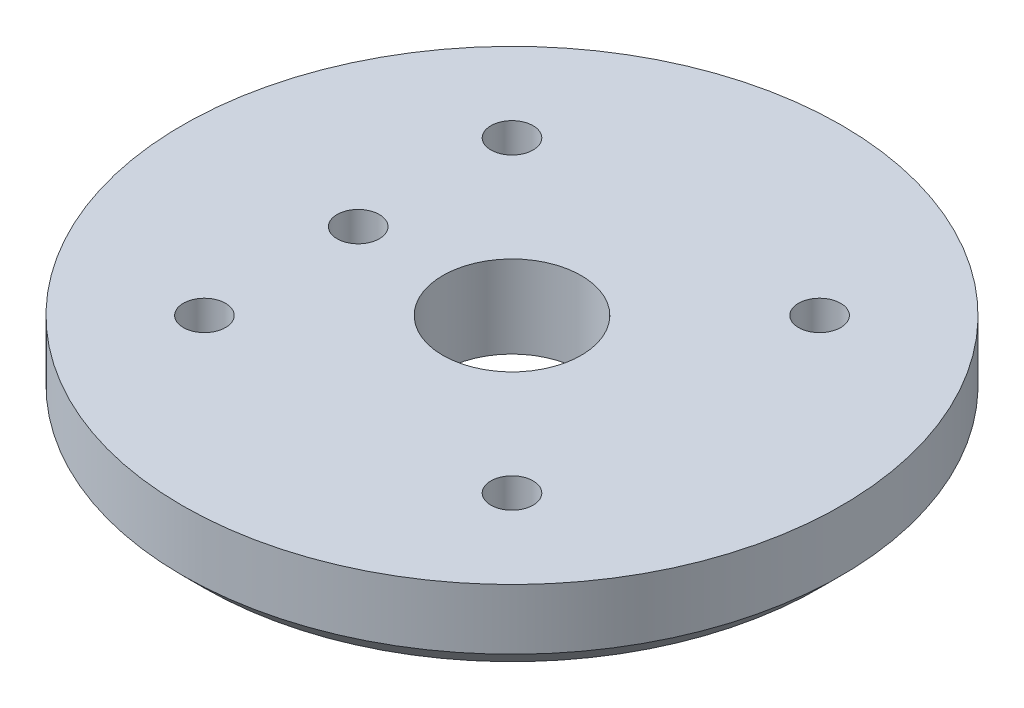
ISO-10303-21;
HEADER;
FILE_DESCRIPTION(('STEP AP214'),'2;1');
FILE_NAME('part.step','',(''),(''),'','','');
FILE_SCHEMA(('AUTOMOTIVE_DESIGN { 1 0 10303 214 1 1 1 1 }'));
ENDSEC;
DATA;
#1=APPLICATION_CONTEXT('core data for automotive mechanical design processes');
#2=APPLICATION_PROTOCOL_DEFINITION('international standard','automotive_design',2000,#1);
#3=PRODUCT_CONTEXT('',#1,'mechanical');
#4=PRODUCT('Part','Part','',(#3));
#5=PRODUCT_RELATED_PRODUCT_CATEGORY('part','',(#4));
#6=PRODUCT_DEFINITION_FORMATION('','',#4);
#7=PRODUCT_DEFINITION_CONTEXT('part definition',#1,'design');
#8=PRODUCT_DEFINITION('design','',#6,#7);
#9=PRODUCT_DEFINITION_SHAPE('','',#8);
#10=(LENGTH_UNIT() NAMED_UNIT(*) SI_UNIT(.MILLI.,.METRE.));
#11=(NAMED_UNIT(*) PLANE_ANGLE_UNIT() SI_UNIT($,.RADIAN.));
#12=(NAMED_UNIT(*) SI_UNIT($,.STERADIAN.) SOLID_ANGLE_UNIT());
#13=UNCERTAINTY_MEASURE_WITH_UNIT(LENGTH_MEASURE(1.E-05),#10,'distance_accuracy_value','');
#14=(GEOMETRIC_REPRESENTATION_CONTEXT(3) GLOBAL_UNCERTAINTY_ASSIGNED_CONTEXT((#13)) GLOBAL_UNIT_ASSIGNED_CONTEXT((#10,
#11,#12)) REPRESENTATION_CONTEXT('',''));
#15=CARTESIAN_POINT('',(0.,0.,0.));
#16=DIRECTION('',(0.,0.,1.));
#17=DIRECTION('',(1.,0.,0.));
#18=AXIS2_PLACEMENT_3D('',#15,#16,#17);
#19=CARTESIAN_POINT('',(0.,4.7625,0.));
#20=DIRECTION('',(0.,1.,0.));
#21=DIRECTION('',(0.,0.,1.));
#22=AXIS2_PLACEMENT_3D('',#19,#20,#21);
#23=PLANE('',#22);
#24=CARTESIAN_POINT('',(-8.89,4.7625,-8.89));
#25=DIRECTION('',(0.,1.,0.));
#26=DIRECTION('',(0.,0.,1.));
#27=AXIS2_PLACEMENT_3D('',#24,#25,#26);
#28=CIRCLE('',#27,1.2192);
#29=CARTESIAN_POINT('',(-8.89,4.7625,-7.6708));
#30=VERTEX_POINT('',#29);
#31=EDGE_CURVE('E85',#30,#30,#28,.T.);
#32=ORIENTED_EDGE('',*,*,#31,.F.);
#33=EDGE_LOOP('',(#32));
#34=FACE_BOUND('',#33,.T.);
#35=CARTESIAN_POINT('',(8.89,4.7625,-8.89));
#36=DIRECTION('',(0.,1.,0.));
#37=DIRECTION('',(0.,0.,1.));
#38=AXIS2_PLACEMENT_3D('',#35,#36,#37);
#39=CIRCLE('',#38,1.2192);
#40=CARTESIAN_POINT('',(8.89,4.7625,-7.6708));
#41=VERTEX_POINT('',#40);
#42=EDGE_CURVE('E79',#41,#41,#39,.T.);
#43=ORIENTED_EDGE('',*,*,#42,.F.);
#44=EDGE_LOOP('',(#43));
#45=FACE_BOUND('',#44,.T.);
#46=CARTESIAN_POINT('',(-8.89,4.7625,8.89));
#47=DIRECTION('',(0.,1.,0.));
#48=DIRECTION('',(0.,0.,1.));
#49=AXIS2_PLACEMENT_3D('',#46,#47,#48);
#50=CIRCLE('',#49,1.2192);
#51=CARTESIAN_POINT('',(-8.89,4.7625,10.1092));
#52=VERTEX_POINT('',#51);
#53=EDGE_CURVE('E73',#52,#52,#50,.T.);
#54=ORIENTED_EDGE('',*,*,#53,.F.);
#55=EDGE_LOOP('',(#54));
#56=FACE_BOUND('',#55,.T.);
#57=CARTESIAN_POINT('',(8.89,4.7625,8.89));
#58=DIRECTION('',(0.,1.,0.));
#59=DIRECTION('',(0.,0.,1.));
#60=AXIS2_PLACEMENT_3D('',#57,#58,#59);
#61=CIRCLE('',#60,1.2192);
#62=CARTESIAN_POINT('',(8.89,4.7625,10.1092));
#63=VERTEX_POINT('',#62);
#64=EDGE_CURVE('E67',#63,#63,#61,.T.);
#65=ORIENTED_EDGE('',*,*,#64,.F.);
#66=EDGE_LOOP('',(#65));
#67=FACE_BOUND('',#66,.T.);
#68=CARTESIAN_POINT('',(-8.89,4.7625,0.));
#69=DIRECTION('',(0.,1.,0.));
#70=DIRECTION('',(0.,0.,1.));
#71=AXIS2_PLACEMENT_3D('',#68,#69,#70);
#72=CIRCLE('',#71,1.2192);
#73=CARTESIAN_POINT('',(-8.89,4.7625,1.2192));
#74=VERTEX_POINT('',#73);
#75=EDGE_CURVE('E61',#74,#74,#72,.T.);
#76=ORIENTED_EDGE('',*,*,#75,.F.);
#77=EDGE_LOOP('',(#76));
#78=FACE_BOUND('',#77,.T.);
#79=CARTESIAN_POINT('',(0.,4.7625,0.));
#80=DIRECTION('',(0.,1.,0.));
#81=DIRECTION('',(0.,0.,1.));
#82=AXIS2_PLACEMENT_3D('',#79,#80,#81);
#83=CIRCLE('',#82,19.05);
#84=CARTESIAN_POINT('',(0.,4.7625,19.05));
#85=VERTEX_POINT('',#84);
#86=EDGE_CURVE('E46',#85,#85,#83,.T.);
#87=ORIENTED_EDGE('',*,*,#86,.T.);
#88=EDGE_LOOP('',(#87));
#89=FACE_BOUND('',#88,.T.);
#90=CARTESIAN_POINT('',(0.,4.7625,0.));
#91=DIRECTION('',(0.,1.,0.));
#92=DIRECTION('',(0.,0.,1.));
#93=AXIS2_PLACEMENT_3D('',#90,#91,#92);
#94=CIRCLE('',#93,4.);
#95=CARTESIAN_POINT('',(0.,4.7625,4.));
#96=VERTEX_POINT('',#95);
#97=EDGE_CURVE('E50',#96,#96,#94,.T.);
#98=ORIENTED_EDGE('',*,*,#97,.F.);
#99=EDGE_LOOP('',(#98));
#100=FACE_BOUND('',#99,.T.);
#101=ADVANCED_FACE('F34',(#34,#45,#56,#67,#78,#89,#100),#23,.T.);
#102=CARTESIAN_POINT('',(0.,0.,0.));
#103=DIRECTION('',(0.,1.,0.));
#104=DIRECTION('',(0.,0.,1.));
#105=AXIS2_PLACEMENT_3D('',#102,#103,#104);
#106=PLANE('',#105);
#107=CARTESIAN_POINT('',(0.,0.,0.));
#108=DIRECTION('',(0.,1.,0.));
#109=DIRECTION('',(0.,0.,1.));
#110=AXIS2_PLACEMENT_3D('',#107,#108,#109);
#111=CIRCLE('',#110,17.78);
#112=CARTESIAN_POINT('',(0.,0.,17.78));
#113=VERTEX_POINT('',#112);
#114=EDGE_CURVE('E10',#113,#113,#111,.F.);
#115=ORIENTED_EDGE('',*,*,#114,.T.);
#116=EDGE_LOOP('',(#115));
#117=FACE_BOUND('',#116,.T.);
#118=CARTESIAN_POINT('',(-8.89,0.,-8.89));
#119=DIRECTION('',(0.,1.,0.));
#120=DIRECTION('',(0.,0.,1.));
#121=AXIS2_PLACEMENT_3D('',#118,#119,#120);
#122=CIRCLE('',#121,1.2192);
#123=CARTESIAN_POINT('',(-8.89,0.,-7.6708));
#124=VERTEX_POINT('',#123);
#125=EDGE_CURVE('E82',#124,#124,#122,.T.);
#126=ORIENTED_EDGE('',*,*,#125,.T.);
#127=EDGE_LOOP('',(#126));
#128=FACE_BOUND('',#127,.T.);
#129=CARTESIAN_POINT('',(8.89,0.,-8.89));
#130=DIRECTION('',(0.,1.,0.));
#131=DIRECTION('',(0.,0.,1.));
#132=AXIS2_PLACEMENT_3D('',#129,#130,#131);
#133=CIRCLE('',#132,1.2192);
#134=CARTESIAN_POINT('',(8.89,0.,-7.6708));
#135=VERTEX_POINT('',#134);
#136=EDGE_CURVE('E76',#135,#135,#133,.T.);
#137=ORIENTED_EDGE('',*,*,#136,.T.);
#138=EDGE_LOOP('',(#137));
#139=FACE_BOUND('',#138,.T.);
#140=CARTESIAN_POINT('',(-8.89,0.,8.89));
#141=DIRECTION('',(0.,1.,0.));
#142=DIRECTION('',(0.,0.,1.));
#143=AXIS2_PLACEMENT_3D('',#140,#141,#142);
#144=CIRCLE('',#143,1.2192);
#145=CARTESIAN_POINT('',(-8.89,0.,10.1092));
#146=VERTEX_POINT('',#145);
#147=EDGE_CURVE('E70',#146,#146,#144,.T.);
#148=ORIENTED_EDGE('',*,*,#147,.T.);
#149=EDGE_LOOP('',(#148));
#150=FACE_BOUND('',#149,.T.);
#151=CARTESIAN_POINT('',(8.89,0.,8.89));
#152=DIRECTION('',(0.,1.,0.));
#153=DIRECTION('',(0.,0.,1.));
#154=AXIS2_PLACEMENT_3D('',#151,#152,#153);
#155=CIRCLE('',#154,1.2192);
#156=CARTESIAN_POINT('',(8.89,0.,10.1092));
#157=VERTEX_POINT('',#156);
#158=EDGE_CURVE('E64',#157,#157,#155,.T.);
#159=ORIENTED_EDGE('',*,*,#158,.T.);
#160=EDGE_LOOP('',(#159));
#161=FACE_BOUND('',#160,.T.);
#162=CARTESIAN_POINT('',(-8.89,0.,0.));
#163=DIRECTION('',(0.,1.,0.));
#164=DIRECTION('',(0.,0.,1.));
#165=AXIS2_PLACEMENT_3D('',#162,#163,#164);
#166=CIRCLE('',#165,1.2192);
#167=CARTESIAN_POINT('',(-8.89,0.,1.2192));
#168=VERTEX_POINT('',#167);
#169=EDGE_CURVE('E56',#168,#168,#166,.T.);
#170=ORIENTED_EDGE('',*,*,#169,.T.);
#171=EDGE_LOOP('',(#170));
#172=FACE_BOUND('',#171,.T.);
#173=CARTESIAN_POINT('',(0.,0.,0.));
#174=DIRECTION('',(0.,1.,0.));
#175=DIRECTION('',(0.,0.,1.));
#176=AXIS2_PLACEMENT_3D('',#173,#174,#175);
#177=CIRCLE('',#176,4.);
#178=CARTESIAN_POINT('',(0.,0.,4.));
#179=VERTEX_POINT('',#178);
#180=EDGE_CURVE('E53',#179,#179,#177,.T.);
#181=ORIENTED_EDGE('',*,*,#180,.T.);
#182=EDGE_LOOP('',(#181));
#183=FACE_BOUND('',#182,.T.);
#184=ADVANCED_FACE('F93',(#117,#128,#139,#150,#161,#172,#183),#106,.F.);
#185=CARTESIAN_POINT('',(0.,4.7625,0.));
#186=DIRECTION('',(0.,-1.,0.));
#187=DIRECTION('',(0.,0.,-1.));
#188=AXIS2_PLACEMENT_3D('',#185,#186,#187);
#189=CYLINDRICAL_SURFACE('',#188,19.05);
#190=CARTESIAN_POINT('',(0.,1.27000000000002,0.));
#191=DIRECTION('',(0.,1.,0.));
#192=DIRECTION('',(0.,0.,1.));
#193=AXIS2_PLACEMENT_3D('',#190,#191,#192);
#194=CIRCLE('',#193,19.05);
#195=CARTESIAN_POINT('',(0.,1.27000000000002,19.05));
#196=VERTEX_POINT('',#195);
#197=EDGE_CURVE('E42',#196,#196,#194,.T.);
#198=ORIENTED_EDGE('',*,*,#197,.T.);
#199=EDGE_LOOP('',(#198));
#200=FACE_BOUND('',#199,.T.);
#201=ORIENTED_EDGE('',*,*,#86,.F.);
#202=EDGE_LOOP('',(#201));
#203=FACE_BOUND('',#202,.T.);
#204=ADVANCED_FACE('F111',(#200,#203),#189,.T.);
#205=CARTESIAN_POINT('',(0.,4.7625,0.));
#206=DIRECTION('',(0.,-1.,0.));
#207=DIRECTION('',(0.,0.,-1.));
#208=AXIS2_PLACEMENT_3D('',#205,#206,#207);
#209=CYLINDRICAL_SURFACE('',#208,4.);
#210=ORIENTED_EDGE('',*,*,#97,.T.);
#211=EDGE_LOOP('',(#210));
#212=FACE_BOUND('',#211,.T.);
#213=ORIENTED_EDGE('',*,*,#180,.F.);
#214=EDGE_LOOP('',(#213));
#215=FACE_BOUND('',#214,.T.);
#216=ADVANCED_FACE('F107',(#212,#215),#209,.F.);
#217=CARTESIAN_POINT('',(-8.89,4.7625,0.));
#218=DIRECTION('',(0.,1.,0.));
#219=DIRECTION('',(0.,0.,1.));
#220=AXIS2_PLACEMENT_3D('',#217,#218,#219);
#221=CYLINDRICAL_SURFACE('',#220,1.2192);
#222=ORIENTED_EDGE('',*,*,#169,.F.);
#223=EDGE_LOOP('',(#222));
#224=FACE_BOUND('',#223,.T.);
#225=ORIENTED_EDGE('',*,*,#75,.T.);
#226=EDGE_LOOP('',(#225));
#227=FACE_BOUND('',#226,.T.);
#228=ADVANCED_FACE('F110',(#224,#227),#221,.F.);
#229=CARTESIAN_POINT('',(8.89,4.7625,8.89));
#230=DIRECTION('',(0.,1.,0.));
#231=DIRECTION('',(0.,0.,1.));
#232=AXIS2_PLACEMENT_3D('',#229,#230,#231);
#233=CYLINDRICAL_SURFACE('',#232,1.2192);
#234=ORIENTED_EDGE('',*,*,#158,.F.);
#235=EDGE_LOOP('',(#234));
#236=FACE_BOUND('',#235,.T.);
#237=ORIENTED_EDGE('',*,*,#64,.T.);
#238=EDGE_LOOP('',(#237));
#239=FACE_BOUND('',#238,.T.);
#240=ADVANCED_FACE('F124',(#236,#239),#233,.F.);
#241=CARTESIAN_POINT('',(-8.89,4.7625,8.89));
#242=DIRECTION('',(0.,1.,0.));
#243=DIRECTION('',(0.,0.,1.));
#244=AXIS2_PLACEMENT_3D('',#241,#242,#243);
#245=CYLINDRICAL_SURFACE('',#244,1.2192);
#246=ORIENTED_EDGE('',*,*,#147,.F.);
#247=EDGE_LOOP('',(#246));
#248=FACE_BOUND('',#247,.T.);
#249=ORIENTED_EDGE('',*,*,#53,.T.);
#250=EDGE_LOOP('',(#249));
#251=FACE_BOUND('',#250,.T.);
#252=ADVANCED_FACE('F128',(#248,#251),#245,.F.);
#253=CARTESIAN_POINT('',(8.89,4.7625,-8.89));
#254=DIRECTION('',(0.,1.,0.));
#255=DIRECTION('',(0.,0.,1.));
#256=AXIS2_PLACEMENT_3D('',#253,#254,#255);
#257=CYLINDRICAL_SURFACE('',#256,1.2192);
#258=ORIENTED_EDGE('',*,*,#136,.F.);
#259=EDGE_LOOP('',(#258));
#260=FACE_BOUND('',#259,.T.);
#261=ORIENTED_EDGE('',*,*,#42,.T.);
#262=EDGE_LOOP('',(#261));
#263=FACE_BOUND('',#262,.T.);
#264=ADVANCED_FACE('F132',(#260,#263),#257,.F.);
#265=CARTESIAN_POINT('',(-8.89,4.7625,-8.89));
#266=DIRECTION('',(0.,1.,0.));
#267=DIRECTION('',(0.,0.,1.));
#268=AXIS2_PLACEMENT_3D('',#265,#266,#267);
#269=CYLINDRICAL_SURFACE('',#268,1.2192);
#270=ORIENTED_EDGE('',*,*,#125,.F.);
#271=EDGE_LOOP('',(#270));
#272=FACE_BOUND('',#271,.T.);
#273=ORIENTED_EDGE('',*,*,#31,.T.);
#274=EDGE_LOOP('',(#273));
#275=FACE_BOUND('',#274,.T.);
#276=ADVANCED_FACE('F89',(#272,#275),#269,.F.);
#277=CARTESIAN_POINT('',(0.,1.27000000000002,0.));
#278=DIRECTION('',(0.,1.,0.));
#279=DIRECTION('',(0.,0.,1.));
#280=AXIS2_PLACEMENT_3D('',#277,#278,#279);
#281=CONICAL_SURFACE('',#280,19.05,0.78539816339745);
#282=ORIENTED_EDGE('',*,*,#114,.F.);
#283=EDGE_LOOP('',(#282));
#284=FACE_BOUND('',#283,.T.);
#285=ORIENTED_EDGE('',*,*,#197,.F.);
#286=EDGE_LOOP('',(#285));
#287=FACE_BOUND('',#286,.T.);
#288=ADVANCED_FACE('F37',(#284,#287),#281,.T.);
#289=CLOSED_SHELL('',(#101,#184,#204,#216,#228,#240,#252,#264,#276,#288));
#290=MANIFOLD_SOLID_BREP('B2',#289);
#291=ADVANCED_BREP_SHAPE_REPRESENTATION('',(#18,#290),#14);
#292=SHAPE_DEFINITION_REPRESENTATION(#9,#291);
ENDSEC;
END-ISO-10303-21;
